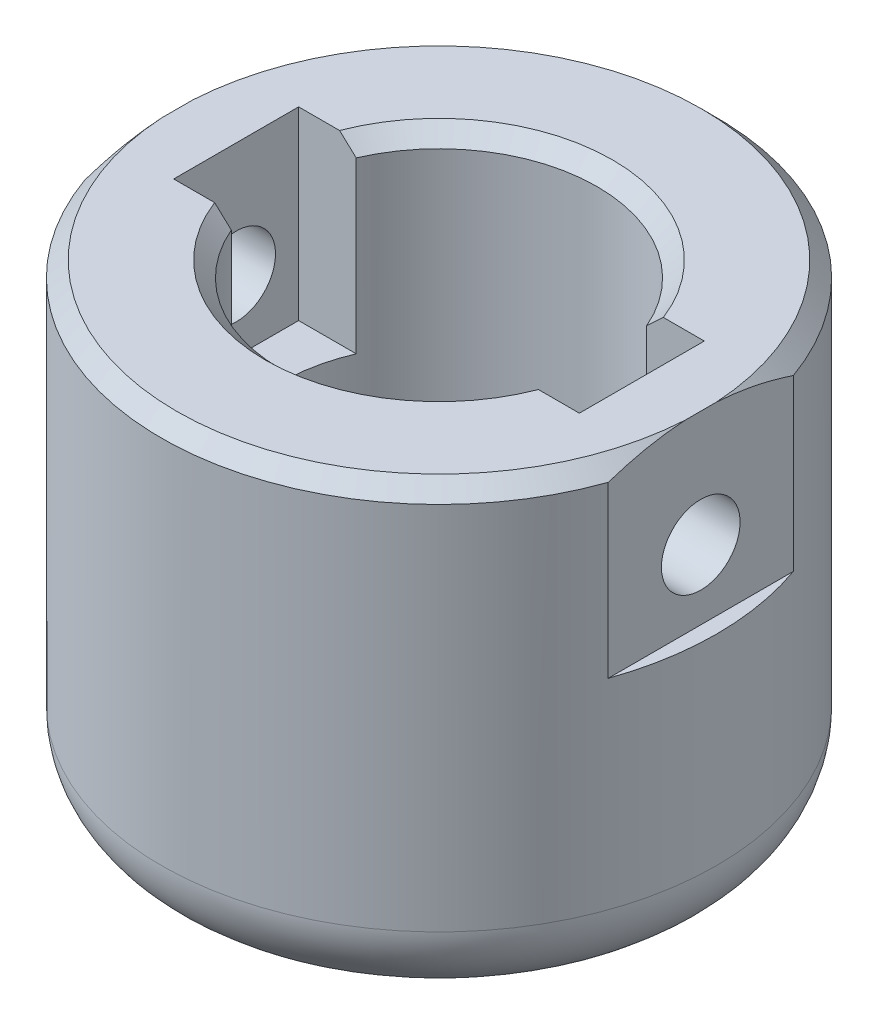
ISO-10303-21;
HEADER;
FILE_DESCRIPTION(('STEP AP214'),'2;1');
FILE_NAME('part.step','',(''),(''),'','','');
FILE_SCHEMA(('AUTOMOTIVE_DESIGN { 1 0 10303 214 1 1 1 1 }'));
ENDSEC;
DATA;
#1=APPLICATION_CONTEXT('core data for automotive mechanical design processes');
#2=APPLICATION_PROTOCOL_DEFINITION('international standard','automotive_design',2000,#1);
#3=PRODUCT_CONTEXT('',#1,'mechanical');
#4=PRODUCT('Part','Part','',(#3));
#5=PRODUCT_RELATED_PRODUCT_CATEGORY('part','',(#4));
#6=PRODUCT_DEFINITION_FORMATION('','',#4);
#7=PRODUCT_DEFINITION_CONTEXT('part definition',#1,'design');
#8=PRODUCT_DEFINITION('design','',#6,#7);
#9=PRODUCT_DEFINITION_SHAPE('','',#8);
#10=(LENGTH_UNIT() NAMED_UNIT(*) SI_UNIT(.MILLI.,.METRE.));
#11=(NAMED_UNIT(*) PLANE_ANGLE_UNIT() SI_UNIT($,.RADIAN.));
#12=(NAMED_UNIT(*) SI_UNIT($,.STERADIAN.) SOLID_ANGLE_UNIT());
#13=UNCERTAINTY_MEASURE_WITH_UNIT(LENGTH_MEASURE(1.E-05),#10,'distance_accuracy_value','');
#14=(GEOMETRIC_REPRESENTATION_CONTEXT(3) GLOBAL_UNCERTAINTY_ASSIGNED_CONTEXT((#13)) GLOBAL_UNIT_ASSIGNED_CONTEXT((#10,
#11,#12)) REPRESENTATION_CONTEXT('',''));
#15=CARTESIAN_POINT('',(0.,0.,0.));
#16=DIRECTION('',(0.,0.,1.));
#17=DIRECTION('',(1.,0.,0.));
#18=AXIS2_PLACEMENT_3D('',#15,#16,#17);
#19=CARTESIAN_POINT('',(-1.02907469966572E-13,29.9999999999999,0.));
#20=DIRECTION('',(0.,1.,0.));
#21=DIRECTION('',(-1.,0.,0.));
#22=AXIS2_PLACEMENT_3D('',#19,#20,#21);
#23=CONICAL_SURFACE('',#22,11.2500000000001,0.785398163397455);
#24=CARTESIAN_POINT('',(7.32678205705659,27.1216327745313,4.04999999999999));
#25=CARTESIAN_POINT('',(7.55646103242014,27.322689122026,4.04999999999999));
#26=CARTESIAN_POINT('',(7.78508291777011,27.5249446682732,4.04999999999999));
#27=CARTESIAN_POINT('',(8.2405597074443,27.9314252753742,4.04999999999999));
#28=CARTESIAN_POINT('',(8.4674146565239,28.1356502860474,4.04999999999999));
#29=CARTESIAN_POINT('',(8.91969403533232,28.5456309185627,4.04999999999999));
#30=CARTESIAN_POINT('',(9.14511860437239,28.751386386971,4.04999999999999));
#31=CARTESIAN_POINT('',(9.59480574969673,29.1641656456228,4.04999999999999));
#32=CARTESIAN_POINT('',(9.81906831755543,29.3711894450391,4.04999999999999));
#33=CARTESIAN_POINT('',(10.4903882449502,29.9937798775828,4.04999999999999));
#34=CARTESIAN_POINT('',(10.9360098612188,30.4108947076921,4.04999999999999));
#35=CARTESIAN_POINT('',(11.6024248378601,31.0387468195385,4.04999999999999));
#36=CARTESIAN_POINT('',(11.8242381594389,31.2484048934746,4.04999999999999));
#37=CARTESIAN_POINT('',(12.2672754085916,31.6683420659301,4.04999999999999));
#38=CARTESIAN_POINT('',(12.4884993373365,31.878621163214,4.04999999999999));
#39=CARTESIAN_POINT('',(12.7094743927895,32.08916186801,4.04999999999999));
#40=B_SPLINE_CURVE_WITH_KNOTS('',3,(#24,#25,#26,#27,#28,#29,#30,#31,#32,#33,#34,#35,#36,#37,#38,
#39),.UNSPECIFIED.,.F.,.F.,(4,2,2,2,2,2,2,4),(0.,0.915730599779071,1.83143792876012,
2.74705466005427,3.66267802114247,5.49379479082767,6.40944638032475,7.32509614926285),.UNSPECIFIED.);
#41=CARTESIAN_POINT('',(9.41594392506664,28.9999999999999,4.04999999999999));
#42=VERTEX_POINT('',#41);
#43=CARTESIAN_POINT('',(10.4957134107216,30.,4.04999999999999));
#44=VERTEX_POINT('',#43);
#45=EDGE_CURVE('E170',#42,#44,#40,.T.);
#46=ORIENTED_EDGE('',*,*,#45,.F.);
#47=CARTESIAN_POINT('',(0.,28.9999999999999,0.));
#48=DIRECTION('',(0.,1.,0.));
#49=DIRECTION('',(-1.,0.,0.));
#50=AXIS2_PLACEMENT_3D('',#47,#48,#49);
#51=CIRCLE('',#50,10.2500000000001);
#52=CARTESIAN_POINT('',(-9.41594392506684,28.9999999999999,4.05));
#53=VERTEX_POINT('',#52);
#54=EDGE_CURVE('E261',#53,#42,#51,.T.);
#55=ORIENTED_EDGE('',*,*,#54,.F.);
#56=CARTESIAN_POINT('',(-12.7094743927899,32.08916186801,4.05));
#57=CARTESIAN_POINT('',(-12.4884993373368,31.878621163214,4.05));
#58=CARTESIAN_POINT('',(-12.2672754085919,31.6683420659302,4.05));
#59=CARTESIAN_POINT('',(-11.8242381594392,31.2484048934746,4.05));
#60=CARTESIAN_POINT('',(-11.6024248378604,31.0387468195385,4.05));
#61=CARTESIAN_POINT('',(-10.9360098612191,30.4108947076921,4.05));
#62=CARTESIAN_POINT('',(-10.4903882449504,29.9937798775828,4.05));
#63=CARTESIAN_POINT('',(-9.81906831755565,29.3711894450391,4.05));
#64=CARTESIAN_POINT('',(-9.59480574969695,29.1641656456227,4.05));
#65=CARTESIAN_POINT('',(-9.14511860437259,28.751386386971,4.05));
#66=CARTESIAN_POINT('',(-8.91969403533251,28.5456309185627,4.05));
#67=CARTESIAN_POINT('',(-8.46741465652407,28.1356502860474,4.05));
#68=CARTESIAN_POINT('',(-8.24055970744446,27.9314252753741,4.05));
#69=CARTESIAN_POINT('',(-7.78508291777025,27.5249446682731,4.05));
#70=CARTESIAN_POINT('',(-7.55646103242027,27.3226891220259,4.05));
#71=CARTESIAN_POINT('',(-7.32678205705671,27.1216327745312,4.05));
#72=B_SPLINE_CURVE_WITH_KNOTS('',3,(#56,#57,#58,#59,#60,#61,#62,#63,#64,#65,#66,#67,#68,#69,#70,
#71),.UNSPECIFIED.,.F.,.F.,(4,2,2,2,2,2,2,4),(0.,0.915649768938141,1.83130135843525,
3.66241812812051,4.57804148920874,5.49365822050293,6.40936554948401,7.32509614926312),.UNSPECIFIED.);
#73=CARTESIAN_POINT('',(-10.4957134107218,29.9999999999999,4.05));
#74=VERTEX_POINT('',#73);
#75=EDGE_CURVE('E405',#74,#53,#72,.T.);
#76=ORIENTED_EDGE('',*,*,#75,.F.);
#77=CARTESIAN_POINT('',(-1.02907469966573E-13,30.,0.));
#78=DIRECTION('',(0.,1.,0.));
#79=DIRECTION('',(-1.,0.,0.));
#80=AXIS2_PLACEMENT_3D('',#77,#78,#79);
#81=CIRCLE('',#80,11.2500000000001);
#82=EDGE_CURVE('E263',#44,#74,#81,.F.);
#83=ORIENTED_EDGE('',*,*,#82,.F.);
#84=EDGE_LOOP('',(#46,#55,#76,#83));
#85=FACE_BOUND('',#84,.T.);
#86=ADVANCED_FACE('F35',(#85),#23,.F.);
#87=CARTESIAN_POINT('',(0.,29.0000000000001,0.));
#88=DIRECTION('',(0.,-1.,0.));
#89=DIRECTION('',(1.,0.,0.));
#90=AXIS2_PLACEMENT_3D('',#87,#88,#89);
#91=CONICAL_SURFACE('',#90,18.,0.785398163397464);
#92=CARTESIAN_POINT('',(16.970562748477,25.4847781561522,-13.2251567472752));
#93=CARTESIAN_POINT('',(16.970562748477,25.6809351306165,-12.9059945777759));
#94=CARTESIAN_POINT('',(16.970562748477,25.8739384322977,-12.5848645366506));
#95=CARTESIAN_POINT('',(16.970562748477,26.2526520620676,-11.9382352634281));
#96=CARTESIAN_POINT('',(16.970562748477,26.4383606563974,-11.6127350170208));
#97=CARTESIAN_POINT('',(16.970562748477,26.8021308972379,-10.9557724507042));
#98=CARTESIAN_POINT('',(16.970562748477,26.9801590236808,-10.6242915048748));
#99=CARTESIAN_POINT('',(16.970562748477,27.3265019852374,-9.95631004758649));
#100=CARTESIAN_POINT('',(16.970562748477,27.4948174079489,-9.6198098413353));
#101=CARTESIAN_POINT('',(16.970562748477,27.8236697209714,-8.93442079746645));
#102=CARTESIAN_POINT('',(16.970562748477,27.9839741115656,-8.58541963608094));
#103=CARTESIAN_POINT('',(16.970562748477,28.2912045937466,-7.88158196486785));
#104=CARTESIAN_POINT('',(16.970562748477,28.4381296218007,-7.52674499379091));
#105=CARTESIAN_POINT('',(16.970562748477,28.8554737690785,-6.45421418256346));
#106=CARTESIAN_POINT('',(16.9705627484771,29.1030742609521,-5.72725460602414));
#107=CARTESIAN_POINT('',(16.9705627484771,29.4509584376996,-4.49384532216474));
#108=CARTESIAN_POINT('',(16.9705627484771,29.5729119345977,-3.99348322231232));
#109=CARTESIAN_POINT('',(16.9705627484771,29.7761029875689,-2.98439373835375));
#110=CARTESIAN_POINT('',(16.9705627484771,29.8573401630234,-2.47566627609363));
#111=CARTESIAN_POINT('',(16.9705627484771,29.9743557820314,-1.4579107639439));
#112=CARTESIAN_POINT('',(16.9705627484771,30.0105646746437,-0.948932836033983));
#113=CARTESIAN_POINT('',(16.9705627484771,30.0369369291092,0.0702136808183589));
#114=CARTESIAN_POINT('',(16.9705627484771,30.0271025181523,0.580382210976276));
#115=CARTESIAN_POINT('',(16.9705627484771,29.9619819000151,1.59731811758356));
#116=CARTESIAN_POINT('',(16.9705627484771,29.9067350019954,2.10408805353443));
#117=CARTESIAN_POINT('',(16.9705627484771,29.7538035014175,3.11114117673942));
#118=CARTESIAN_POINT('',(16.9705627484771,29.6561142825717,3.61142365228008));
#119=CARTESIAN_POINT('',(16.9705627484771,29.421819609194,4.60750109563117));
#120=CARTESIAN_POINT('',(16.9705627484771,29.2848668000616,5.1032133198858));
#121=CARTESIAN_POINT('',(16.9705627484771,28.9778032291246,6.08413459839825));
#122=CARTESIAN_POINT('',(16.9705627484771,28.8076924054738,6.56934363306369));
#123=CARTESIAN_POINT('',(16.9705627484771,28.4145958833882,7.59412108388862));
#124=CARTESIAN_POINT('',(16.9705627484771,28.1875672809049,8.13212787077785));
#125=CARTESIAN_POINT('',(16.9705627484772,27.7043221723622,9.19496333475703));
#126=CARTESIAN_POINT('',(16.9705627484772,27.4480949410739,9.71978708250893));
#127=CARTESIAN_POINT('',(16.9705627484772,26.9172019887956,10.7474979573489));
#128=CARTESIAN_POINT('',(16.9705627484772,26.6429729495695,11.25061195798));
#129=CARTESIAN_POINT('',(16.9705627484772,26.2180672226552,11.9971012190895));
#130=CARTESIAN_POINT('',(16.9705627484772,26.0742589733062,12.2444262333171));
#131=CARTESIAN_POINT('',(16.9705627484772,25.7825129161461,12.736600078464));
#132=CARTESIAN_POINT('',(16.9705627484772,25.634575479165,12.9814491290691));
#133=CARTESIAN_POINT('',(16.9705627484772,25.4847781561522,13.225156747275));
#134=B_SPLINE_CURVE_WITH_KNOTS('',3,(#92,#93,#94,#95,#96,#97,#98,#99,#100,#101,#102,#103,#104,
#105,#106,#107,#108,#109,#110,#111,#112,#113,#114,#115,#116,#117,#118,#119,#120,#121,#122,#123,
#124,#125,#126,#127,#128,#129,#130,#131,#132,#133),.UNSPECIFIED.,.F.,.F.,(4,2,2,2,2,2,2,2,2,2,2,
2,2,2,2,2,2,2,2,2,4),(0.,1.12388643091389,2.2480383832806,3.37668213494155,4.50525753432825,
5.65714564160895,6.80912523330326,9.10893094696375,10.6525600084569,12.196203499612,
13.7249741374504,15.2536708269222,16.7810456644986,18.3085866703467,19.8500820421742,
21.3915802892202,23.1423260230731,24.8937169257438,26.612214301044,27.4704677446396,
28.32864435746),.UNSPECIFIED.);
#135=CARTESIAN_POINT('',(16.9705627484771,29.0000000000002,-6.00000000000001));
#136=VERTEX_POINT('',#135);
#137=CARTESIAN_POINT('',(16.9705627484771,30.,-1.00000000000181));
#138=VERTEX_POINT('',#137);
#139=EDGE_CURVE('E219',#136,#138,#134,.T.);
#140=ORIENTED_EDGE('',*,*,#139,.F.);
#141=CARTESIAN_POINT('',(0.,29.0000000000001,0.));
#142=DIRECTION('',(0.,1.,0.));
#143=DIRECTION('',(-1.,0.,0.));
#144=AXIS2_PLACEMENT_3D('',#141,#142,#143);
#145=CIRCLE('',#144,18.);
#146=CARTESIAN_POINT('',(-16.9705627484773,29.,-6.00000000000001));
#147=VERTEX_POINT('',#146);
#148=EDGE_CURVE('E277',#147,#136,#145,.F.);
#149=ORIENTED_EDGE('',*,*,#148,.F.);
#150=CARTESIAN_POINT('',(-16.9705627484773,25.4847781561519,13.2251567472754));
#151=CARTESIAN_POINT('',(-16.9705627484773,25.6809351306162,12.905994577776));
#152=CARTESIAN_POINT('',(-16.9705627484773,25.8739384322975,12.5848645366507));
#153=CARTESIAN_POINT('',(-16.9705627484773,26.2526520620674,11.9382352634282));
#154=CARTESIAN_POINT('',(-16.9705627484773,26.4383606563972,11.6127350170209));
#155=CARTESIAN_POINT('',(-16.9705627484773,26.8021308972376,10.9557724507042));
#156=CARTESIAN_POINT('',(-16.9705627484773,26.9801590236805,10.6242915048749));
#157=CARTESIAN_POINT('',(-16.9705627484773,27.3265019852371,9.95631004758655));
#158=CARTESIAN_POINT('',(-16.9705627484773,27.4948174079487,9.61980984133535));
#159=CARTESIAN_POINT('',(-16.9705627484773,27.8236697209713,8.9344207974665));
#160=CARTESIAN_POINT('',(-16.9705627484773,27.9839741115654,8.58541963608098));
#161=CARTESIAN_POINT('',(-16.9705627484773,28.2912045937464,7.88158196486788));
#162=CARTESIAN_POINT('',(-16.9705627484773,28.4381296218006,7.52674499379094));
#163=CARTESIAN_POINT('',(-16.9705627484773,28.8554737690783,6.45421418256347));
#164=CARTESIAN_POINT('',(-16.9705627484773,29.103074260952,5.72725460602413));
#165=CARTESIAN_POINT('',(-16.9705627484773,29.4509584376994,4.49384532216471));
#166=CARTESIAN_POINT('',(-16.9705627484773,29.5729119345976,3.99348322231229));
#167=CARTESIAN_POINT('',(-16.9705627484773,29.7761029875688,2.98439373835372));
#168=CARTESIAN_POINT('',(-16.9705627484773,29.8573401630233,2.47566627609361));
#169=CARTESIAN_POINT('',(-16.9705627484773,29.9743557820313,1.45791076394387));
#170=CARTESIAN_POINT('',(-16.9705627484773,30.0105646746436,0.948932836033951));
#171=CARTESIAN_POINT('',(-16.9705627484773,30.0369369291091,-0.0702136808183932));
#172=CARTESIAN_POINT('',(-16.9705627484773,30.0271025181521,-0.580382210976311));
#173=CARTESIAN_POINT('',(-16.9705627484773,29.9619819000149,-1.5973181175836));
#174=CARTESIAN_POINT('',(-16.9705627484773,29.9067350019953,-2.10408805353447));
#175=CARTESIAN_POINT('',(-16.9705627484773,29.7538035014174,-3.11114117673946));
#176=CARTESIAN_POINT('',(-16.9705627484773,29.6561142825717,-3.61142365228013));
#177=CARTESIAN_POINT('',(-16.9705627484773,29.4218196091939,-4.60750109563122));
#178=CARTESIAN_POINT('',(-16.9705627484773,29.2848668000615,-5.10321331988585));
#179=CARTESIAN_POINT('',(-16.9705627484773,28.9778032291245,-6.08413459839831));
#180=CARTESIAN_POINT('',(-16.9705627484773,28.8076924054737,-6.56934363306374));
#181=CARTESIAN_POINT('',(-16.9705627484773,28.4145958833881,-7.59412108388871));
#182=CARTESIAN_POINT('',(-16.9705627484773,28.1875672809048,-8.13212787077796));
#183=CARTESIAN_POINT('',(-16.9705627484773,27.7043221723621,-9.1949633347572));
#184=CARTESIAN_POINT('',(-16.9705627484773,27.4480949410737,-9.71978708250913));
#185=CARTESIAN_POINT('',(-16.9705627484773,26.9172019887954,-10.7474979573491));
#186=CARTESIAN_POINT('',(-16.9705627484773,26.6429729495693,-11.2506119579802));
#187=CARTESIAN_POINT('',(-16.9705627484773,26.2180672226549,-11.9971012190899));
#188=CARTESIAN_POINT('',(-16.9705627484773,26.074258973306,-12.2444262333174));
#189=CARTESIAN_POINT('',(-16.9705627484773,25.7825129161458,-12.7366000784644));
#190=CARTESIAN_POINT('',(-16.9705627484773,25.6345754791648,-12.9814491290694));
#191=CARTESIAN_POINT('',(-16.9705627484773,25.4847781561519,-13.2251567472754));
#192=B_SPLINE_CURVE_WITH_KNOTS('',3,(#150,#151,#152,#153,#154,#155,#156,#157,#158,#159,#160,
#161,#162,#163,#164,#165,#166,#167,#168,#169,#170,#171,#172,#173,#174,#175,#176,#177,#178,#179,
#180,#181,#182,#183,#184,#185,#186,#187,#188,#189,#190,#191),.UNSPECIFIED.,.F.,.F.,(4,2,2,2,2,2,
2,2,2,2,2,2,2,2,2,2,2,2,2,2,4),(0.,1.12388643091392,2.24803838328065,3.37668213494162,
4.50525753432834,5.65714564160906,6.80912523330339,9.10893094696392,10.6525600084571,
12.1962034996122,13.7249741374506,15.2536708269224,16.7810456644987,18.3085866703469,
19.8500820421744,21.3915802892204,23.1423260230734,24.8937169257442,26.6122143010445,
27.4704677446401,28.3286443574606),.UNSPECIFIED.);
#193=CARTESIAN_POINT('',(-16.9705627484773,29.9999999999999,-1.00000000000164));
#194=VERTEX_POINT('',#193);
#195=EDGE_CURVE('E155',#194,#147,#192,.T.);
#196=ORIENTED_EDGE('',*,*,#195,.F.);
#197=CARTESIAN_POINT('',(-1.02907469966573E-13,30.,0.));
#198=DIRECTION('',(0.,1.,0.));
#199=DIRECTION('',(-1.,0.,0.));
#200=AXIS2_PLACEMENT_3D('',#197,#198,#199);
#201=CIRCLE('',#200,17.0000000000001);
#202=EDGE_CURVE('E301',#138,#194,#201,.T.);
#203=ORIENTED_EDGE('',*,*,#202,.F.);
#204=EDGE_LOOP('',(#140,#149,#196,#203));
#205=FACE_BOUND('',#204,.T.);
#206=ADVANCED_FACE('F240',(#205),#91,.T.);
#207=CARTESIAN_POINT('',(1.46504285751069E-12,-427.095192794044,0.));
#208=DIRECTION('',(0.,-1.,0.));
#209=DIRECTION('',(1.,0.,0.));
#210=AXIS2_PLACEMENT_3D('',#207,#208,#209);
#211=CYLINDRICAL_SURFACE('',#210,18.);
#212=DIRECTION('',(0.,1.,0.));
#213=VECTOR('',#212,1.);
#214=CARTESIAN_POINT('',(16.9705627484772,18.,5.99999999999977));
#215=LINE('',#214,#213);
#216=CARTESIAN_POINT('',(16.9705627484772,18.,5.99999999999977));
#217=VERTEX_POINT('',#216);
#218=CARTESIAN_POINT('',(16.9705627484771,29.0000000000002,5.99999999999977));
#219=VERTEX_POINT('',#218);
#220=EDGE_CURVE('E344',#217,#219,#215,.T.);
#221=ORIENTED_EDGE('',*,*,#220,.T.);
#222=CARTESIAN_POINT('',(-16.9705627484773,29.,5.99999999999999));
#223=VERTEX_POINT('',#222);
#224=EDGE_CURVE('E274',#219,#223,#145,.F.);
#225=ORIENTED_EDGE('',*,*,#224,.T.);
#226=DIRECTION('',(0.,1.,0.));
#227=VECTOR('',#226,1.);
#228=CARTESIAN_POINT('',(-16.9705627484773,17.9999999999999,5.99999999999999));
#229=LINE('',#228,#227);
#230=CARTESIAN_POINT('',(-16.9705627484773,17.9999999999999,5.99999999999999));
#231=VERTEX_POINT('',#230);
#232=EDGE_CURVE('E160',#231,#223,#229,.T.);
#233=ORIENTED_EDGE('',*,*,#232,.F.);
#234=CARTESIAN_POINT('',(0.,18.,0.));
#235=DIRECTION('',(0.,-1.,0.));
#236=DIRECTION('',(1.,0.,0.));
#237=AXIS2_PLACEMENT_3D('',#234,#235,#236);
#238=CIRCLE('',#237,18.);
#239=CARTESIAN_POINT('',(-16.9705627484773,17.9999999999999,-6.00000000000001));
#240=VERTEX_POINT('',#239);
#241=EDGE_CURVE('E44',#240,#231,#238,.F.);
#242=ORIENTED_EDGE('',*,*,#241,.F.);
#243=DIRECTION('',(0.,1.,0.));
#244=VECTOR('',#243,1.);
#245=CARTESIAN_POINT('',(-16.9705627484773,17.9999999999999,-6.00000000000001));
#246=LINE('',#245,#244);
#247=EDGE_CURVE('E149',#240,#147,#246,.T.);
#248=ORIENTED_EDGE('',*,*,#247,.T.);
#249=ORIENTED_EDGE('',*,*,#148,.T.);
#250=DIRECTION('',(0.,1.,0.));
#251=VECTOR('',#250,1.);
#252=CARTESIAN_POINT('',(16.9705627484771,18.,-6.00000000000001));
#253=LINE('',#252,#251);
#254=CARTESIAN_POINT('',(16.9705627484771,18.,-6.00000000000001));
#255=VERTEX_POINT('',#254);
#256=EDGE_CURVE('E342',#255,#136,#253,.T.);
#257=ORIENTED_EDGE('',*,*,#256,.F.);
#258=CARTESIAN_POINT('',(0.,18.,0.));
#259=DIRECTION('',(0.,1.,0.));
#260=DIRECTION('',(-1.,0.,0.));
#261=AXIS2_PLACEMENT_3D('',#258,#259,#260);
#262=CIRCLE('',#261,18.);
#263=EDGE_CURVE('E12',#255,#217,#262,.F.);
#264=ORIENTED_EDGE('',*,*,#263,.T.);
#265=EDGE_LOOP('',(#221,#225,#233,#242,#248,#249,#257,#264));
#266=FACE_BOUND('',#265,.T.);
#267=CARTESIAN_POINT('',(0.,4.99999999999995,0.));
#268=DIRECTION('',(0.,-1.,0.));
#269=DIRECTION('',(1.,0.,0.));
#270=AXIS2_PLACEMENT_3D('',#267,#268,#269);
#271=CIRCLE('',#270,18.);
#272=CARTESIAN_POINT('',(18.,5.00000000000001,0.));
#273=VERTEX_POINT('',#272);
#274=EDGE_CURVE('E286',#273,#273,#271,.F.);
#275=ORIENTED_EDGE('',*,*,#274,.T.);
#276=EDGE_LOOP('',(#275));
#277=FACE_BOUND('',#276,.T.);
#278=ADVANCED_FACE('F167',(#266,#277),#211,.T.);
#279=CARTESIAN_POINT('',(18.,0.,0.));
#280=DIRECTION('',(0.,-1.,0.));
#281=DIRECTION('',(1.,0.,0.));
#282=AXIS2_PLACEMENT_3D('',#279,#280,#281);
#283=PLANE('',#282);
#284=CARTESIAN_POINT('',(0.,0.,0.));
#285=DIRECTION('',(0.,-1.,0.));
#286=DIRECTION('',(1.,0.,0.));
#287=AXIS2_PLACEMENT_3D('',#284,#285,#286);
#288=CIRCLE('',#287,13.);
#289=CARTESIAN_POINT('',(13.,0.,0.));
#290=VERTEX_POINT('',#289);
#291=EDGE_CURVE('E284',#290,#290,#288,.T.);
#292=ORIENTED_EDGE('',*,*,#291,.T.);
#293=EDGE_LOOP('',(#292));
#294=FACE_BOUND('',#293,.T.);
#295=CARTESIAN_POINT('',(0.,0.,0.));
#296=DIRECTION('',(0.,-1.,0.));
#297=DIRECTION('',(1.,0.,0.));
#298=AXIS2_PLACEMENT_3D('',#295,#296,#297);
#299=CIRCLE('',#298,5.25);
#300=CARTESIAN_POINT('',(5.25,0.,0.));
#301=VERTEX_POINT('',#300);
#302=EDGE_CURVE('E310',#301,#301,#299,.T.);
#303=ORIENTED_EDGE('',*,*,#302,.F.);
#304=EDGE_LOOP('',(#303));
#305=FACE_BOUND('',#304,.T.);
#306=ADVANCED_FACE('F430',(#294,#305),#283,.T.);
#307=CARTESIAN_POINT('',(1.46504285751069E-12,-427.095192794044,0.));
#308=DIRECTION('',(0.,-1.,0.));
#309=DIRECTION('',(1.,0.,0.));
#310=AXIS2_PLACEMENT_3D('',#307,#308,#309);
#311=CYLINDRICAL_SURFACE('',#310,5.25000000000001);
#312=ORIENTED_EDGE('',*,*,#302,.T.);
#313=EDGE_LOOP('',(#312));
#314=FACE_BOUND('',#313,.T.);
#315=CARTESIAN_POINT('',(0.,3.,0.));
#316=DIRECTION('',(0.,-1.,0.));
#317=DIRECTION('',(1.,0.,0.));
#318=AXIS2_PLACEMENT_3D('',#315,#316,#317);
#319=CIRCLE('',#318,5.25000000000001);
#320=CARTESIAN_POINT('',(5.25,3.00000000000002,0.));
#321=VERTEX_POINT('',#320);
#322=EDGE_CURVE('E313',#321,#321,#319,.T.);
#323=ORIENTED_EDGE('',*,*,#322,.F.);
#324=EDGE_LOOP('',(#323));
#325=FACE_BOUND('',#324,.T.);
#326=ADVANCED_FACE('F426',(#314,#325),#311,.F.);
#327=CARTESIAN_POINT('',(5.25,2.99999999999999,0.));
#328=DIRECTION('',(0.,1.,0.));
#329=DIRECTION('',(-1.,0.,0.));
#330=AXIS2_PLACEMENT_3D('',#327,#328,#329);
#331=PLANE('',#330);
#332=CARTESIAN_POINT('',(0.,2.99999999999997,0.));
#333=DIRECTION('',(0.,1.,0.));
#334=DIRECTION('',(-1.,0.,0.));
#335=AXIS2_PLACEMENT_3D('',#332,#333,#334);
#336=CIRCLE('',#335,9.25000000000006);
#337=CARTESIAN_POINT('',(-9.25000000000007,2.99999999999994,0.));
#338=VERTEX_POINT('',#337);
#339=EDGE_CURVE('E303',#338,#338,#336,.T.);
#340=ORIENTED_EDGE('',*,*,#339,.T.);
#341=EDGE_LOOP('',(#340));
#342=FACE_BOUND('',#341,.T.);
#343=ORIENTED_EDGE('',*,*,#322,.T.);
#344=EDGE_LOOP('',(#343));
#345=FACE_BOUND('',#344,.T.);
#346=ADVANCED_FACE('F423',(#342,#345),#331,.T.);
#347=CARTESIAN_POINT('',(1.46504285751069E-12,-427.095192794044,0.));
#348=DIRECTION('',(0.,-1.,0.));
#349=DIRECTION('',(1.,0.,0.));
#350=AXIS2_PLACEMENT_3D('',#347,#348,#349);
#351=CYLINDRICAL_SURFACE('',#350,10.2500000000001);
#352=DIRECTION('',(0.,1.,0.));
#353=VECTOR('',#352,1.);
#354=CARTESIAN_POINT('',(9.41594392506668,18.,4.04999999999999));
#355=LINE('',#354,#353);
#356=CARTESIAN_POINT('',(9.41594392506668,18.,4.04999999999999));
#357=VERTEX_POINT('',#356);
#358=EDGE_CURVE('E271',#357,#42,#355,.T.);
#359=ORIENTED_EDGE('',*,*,#358,.F.);
#360=CARTESIAN_POINT('',(0.,18.,0.));
#361=DIRECTION('',(0.,-1.,0.));
#362=DIRECTION('',(-1.,0.,0.));
#363=AXIS2_PLACEMENT_3D('',#360,#361,#362);
#364=CIRCLE('',#363,10.2500000000001);
#365=CARTESIAN_POINT('',(9.41594392506668,18.,-4.05));
#366=VERTEX_POINT('',#365);
#367=EDGE_CURVE('E357',#366,#357,#364,.T.);
#368=ORIENTED_EDGE('',*,*,#367,.F.);
#369=DIRECTION('',(0.,1.,0.));
#370=VECTOR('',#369,1.);
#371=CARTESIAN_POINT('',(9.41594392506668,18.,-4.05));
#372=LINE('',#371,#370);
#373=CARTESIAN_POINT('',(9.41594392506664,29.,-4.05));
#374=VERTEX_POINT('',#373);
#375=EDGE_CURVE('E359',#366,#374,#372,.T.);
#376=ORIENTED_EDGE('',*,*,#375,.T.);
#377=CARTESIAN_POINT('',(-9.41594392506683,28.9999999999999,-4.05000000000001));
#378=VERTEX_POINT('',#377);
#379=EDGE_CURVE('E275',#374,#378,#51,.T.);
#380=ORIENTED_EDGE('',*,*,#379,.T.);
#381=DIRECTION('',(0.,1.,0.));
#382=VECTOR('',#381,1.);
#383=CARTESIAN_POINT('',(-9.4159439250668,17.9999999999999,-4.05));
#384=LINE('',#383,#382);
#385=CARTESIAN_POINT('',(-9.4159439250668,17.9999999999999,-4.05));
#386=VERTEX_POINT('',#385);
#387=EDGE_CURVE('E59',#386,#378,#384,.T.);
#388=ORIENTED_EDGE('',*,*,#387,.F.);
#389=CARTESIAN_POINT('',(0.,18.,0.));
#390=DIRECTION('',(0.,-1.,0.));
#391=DIRECTION('',(-1.,0.,0.));
#392=AXIS2_PLACEMENT_3D('',#389,#390,#391);
#393=CIRCLE('',#392,10.2500000000001);
#394=CARTESIAN_POINT('',(-9.4159439250668,17.9999999999999,4.05));
#395=VERTEX_POINT('',#394);
#396=EDGE_CURVE('E337',#395,#386,#393,.T.);
#397=ORIENTED_EDGE('',*,*,#396,.F.);
#398=DIRECTION('',(0.,1.,0.));
#399=VECTOR('',#398,1.);
#400=CARTESIAN_POINT('',(-9.4159439250668,17.9999999999999,4.05));
#401=LINE('',#400,#399);
#402=EDGE_CURVE('E273',#395,#53,#401,.T.);
#403=ORIENTED_EDGE('',*,*,#402,.T.);
#404=ORIENTED_EDGE('',*,*,#54,.T.);
#405=EDGE_LOOP('',(#359,#368,#376,#380,#388,#397,#403,#404));
#406=FACE_BOUND('',#405,.T.);
#407=CARTESIAN_POINT('',(0.,4.,0.));
#408=DIRECTION('',(0.,1.,0.));
#409=DIRECTION('',(-1.,0.,0.));
#410=AXIS2_PLACEMENT_3D('',#407,#408,#409);
#411=CIRCLE('',#410,10.2500000000001);
#412=CARTESIAN_POINT('',(-10.2500000000001,3.99999999999997,0.));
#413=VERTEX_POINT('',#412);
#414=EDGE_CURVE('E307',#413,#413,#411,.F.);
#415=ORIENTED_EDGE('',*,*,#414,.T.);
#416=EDGE_LOOP('',(#415));
#417=FACE_BOUND('',#416,.T.);
#418=ADVANCED_FACE('F268',(#406,#417),#351,.F.);
#419=CARTESIAN_POINT('',(10.25,30.,0.));
#420=DIRECTION('',(0.,1.,0.));
#421=DIRECTION('',(-1.,0.,0.));
#422=AXIS2_PLACEMENT_3D('',#419,#420,#421);
#423=PLANE('',#422);
#424=DIRECTION('',(0.,0.,1.));
#425=VECTOR('',#424,1.);
#426=CARTESIAN_POINT('',(16.9705627484771,30.,5.99999999999977));
#427=LINE('',#426,#425);
#428=CARTESIAN_POINT('',(16.9705627484771,30.,1.00000000000157));
#429=VERTEX_POINT('',#428);
#430=EDGE_CURVE('E348',#138,#429,#427,.T.);
#431=ORIENTED_EDGE('',*,*,#430,.F.);
#432=ORIENTED_EDGE('',*,*,#202,.T.);
#433=DIRECTION('',(0.,0.,-1.));
#434=VECTOR('',#433,1.);
#435=CARTESIAN_POINT('',(-16.9705627484773,29.9999999999999,5.99999999999999));
#436=LINE('',#435,#434);
#437=CARTESIAN_POINT('',(-16.9705627484773,29.9999999999999,1.00000000000164));
#438=VERTEX_POINT('',#437);
#439=EDGE_CURVE('E164',#438,#194,#436,.T.);
#440=ORIENTED_EDGE('',*,*,#439,.F.);
#441=EDGE_CURVE('E299',#438,#429,#201,.T.);
#442=ORIENTED_EDGE('',*,*,#441,.T.);
#443=EDGE_LOOP('',(#431,#432,#440,#442));
#444=FACE_BOUND('',#443,.T.);
#445=DIRECTION('',(1.,0.,0.));
#446=VECTOR('',#445,1.);
#447=CARTESIAN_POINT('',(13.15,30.,4.04999999999999));
#448=LINE('',#447,#446);
#449=CARTESIAN_POINT('',(13.15,30.,4.04999999999999));
#450=VERTEX_POINT('',#449);
#451=EDGE_CURVE('E347',#44,#450,#448,.T.);
#452=ORIENTED_EDGE('',*,*,#451,.F.);
#453=ORIENTED_EDGE('',*,*,#82,.T.);
#454=DIRECTION('',(1.,0.,0.));
#455=VECTOR('',#454,1.);
#456=CARTESIAN_POINT('',(-13.1500000000002,29.9999999999999,4.05));
#457=LINE('',#456,#455);
#458=CARTESIAN_POINT('',(-13.1500000000002,29.9999999999999,4.05));
#459=VERTEX_POINT('',#458);
#460=EDGE_CURVE('E330',#459,#74,#457,.T.);
#461=ORIENTED_EDGE('',*,*,#460,.F.);
#462=DIRECTION('',(0.,0.,1.));
#463=VECTOR('',#462,1.);
#464=CARTESIAN_POINT('',(-13.1500000000002,29.9999999999999,4.05));
#465=LINE('',#464,#463);
#466=CARTESIAN_POINT('',(-13.1500000000002,29.9999999999999,-4.05));
#467=VERTEX_POINT('',#466);
#468=EDGE_CURVE('E324',#467,#459,#465,.T.);
#469=ORIENTED_EDGE('',*,*,#468,.F.);
#470=DIRECTION('',(-1.,0.,0.));
#471=VECTOR('',#470,1.);
#472=CARTESIAN_POINT('',(-13.1500000000002,29.9999999999999,-4.05));
#473=LINE('',#472,#471);
#474=CARTESIAN_POINT('',(-10.4957134107218,29.9999999999999,-4.05));
#475=VERTEX_POINT('',#474);
#476=EDGE_CURVE('E328',#475,#467,#473,.T.);
#477=ORIENTED_EDGE('',*,*,#476,.F.);
#478=CARTESIAN_POINT('',(10.4957134107216,30.,-4.05));
#479=VERTEX_POINT('',#478);
#480=EDGE_CURVE('E280',#475,#479,#81,.F.);
#481=ORIENTED_EDGE('',*,*,#480,.T.);
#482=DIRECTION('',(-1.,0.,0.));
#483=VECTOR('',#482,1.);
#484=CARTESIAN_POINT('',(13.15,30.,-4.05));
#485=LINE('',#484,#483);
#486=CARTESIAN_POINT('',(13.15,30.,-4.05));
#487=VERTEX_POINT('',#486);
#488=EDGE_CURVE('E51',#487,#479,#485,.T.);
#489=ORIENTED_EDGE('',*,*,#488,.F.);
#490=DIRECTION('',(0.,0.,-1.));
#491=VECTOR('',#490,1.);
#492=CARTESIAN_POINT('',(13.15,30.,4.04999999999999));
#493=LINE('',#492,#491);
#494=EDGE_CURVE('E365',#450,#487,#493,.T.);
#495=ORIENTED_EDGE('',*,*,#494,.F.);
#496=EDGE_LOOP('',(#452,#453,#461,#469,#477,#481,#489,#495));
#497=FACE_BOUND('',#496,.T.);
#498=ADVANCED_FACE('F297',(#444,#497),#423,.T.);
#499=CARTESIAN_POINT('',(0.,4.,0.));
#500=DIRECTION('',(0.,1.,0.));
#501=DIRECTION('',(-1.,0.,0.));
#502=AXIS2_PLACEMENT_3D('',#499,#500,#501);
#503=TOROIDAL_SURFACE('',#502,9.25000000000006,1.);
#504=ORIENTED_EDGE('',*,*,#339,.F.);
#505=EDGE_LOOP('',(#504));
#506=FACE_BOUND('',#505,.T.);
#507=ORIENTED_EDGE('',*,*,#414,.F.);
#508=EDGE_LOOP('',(#507));
#509=FACE_BOUND('',#508,.T.);
#510=ADVANCED_FACE('F247',(#506,#509),#503,.F.);
#511=CARTESIAN_POINT('',(12.7094743927895,32.08916186801,-4.05));
#512=CARTESIAN_POINT('',(12.4884993373365,31.878621163214,-4.05));
#513=CARTESIAN_POINT('',(12.2672754085916,31.6683420659302,-4.05));
#514=CARTESIAN_POINT('',(11.8242381594389,31.2484048934746,-4.05));
#515=CARTESIAN_POINT('',(11.6024248378601,31.0387468195385,-4.05));
#516=CARTESIAN_POINT('',(10.9360098612188,30.4108947076921,-4.05));
#517=CARTESIAN_POINT('',(10.4903882449502,29.9937798775828,-4.05));
#518=CARTESIAN_POINT('',(9.81906831755543,29.3711894450391,-4.05));
#519=CARTESIAN_POINT('',(9.59480574969673,29.1641656456228,-4.05));
#520=CARTESIAN_POINT('',(9.14511860437239,28.751386386971,-4.05));
#521=CARTESIAN_POINT('',(8.91969403533232,28.5456309185627,-4.05));
#522=CARTESIAN_POINT('',(8.4674146565239,28.1356502860474,-4.05));
#523=CARTESIAN_POINT('',(8.2405597074443,27.9314252753742,-4.05));
#524=CARTESIAN_POINT('',(7.7850829177701,27.5249446682732,-4.05));
#525=CARTESIAN_POINT('',(7.55646103242014,27.322689122026,-4.05));
#526=CARTESIAN_POINT('',(7.32678205705658,27.1216327745313,-4.05));
#527=B_SPLINE_CURVE_WITH_KNOTS('',3,(#511,#512,#513,#514,#515,#516,#517,#518,#519,#520,#521,
#522,#523,#524,#525,#526),.UNSPECIFIED.,.F.,.F.,(4,2,2,2,2,2,2,4),(0.,0.915649768938106,
1.83130135843518,3.66241812812038,4.57804148920858,5.49365822050274,6.40936554948379,
7.32509614926286),.UNSPECIFIED.);
#528=EDGE_CURVE('E172',#479,#374,#527,.T.);
#529=ORIENTED_EDGE('',*,*,#528,.F.);
#530=ORIENTED_EDGE('',*,*,#480,.F.);
#531=CARTESIAN_POINT('',(-7.32678205705671,27.1216327745312,-4.05));
#532=CARTESIAN_POINT('',(-7.55646103242027,27.3226891220259,-4.05));
#533=CARTESIAN_POINT('',(-7.78508291777025,27.5249446682731,-4.05));
#534=CARTESIAN_POINT('',(-8.24055970744446,27.9314252753741,-4.05));
#535=CARTESIAN_POINT('',(-8.46741465652407,28.1356502860474,-4.05));
#536=CARTESIAN_POINT('',(-8.91969403533251,28.5456309185627,-4.05));
#537=CARTESIAN_POINT('',(-9.14511860437259,28.751386386971,-4.05));
#538=CARTESIAN_POINT('',(-9.59480574969695,29.1641656456228,-4.05));
#539=CARTESIAN_POINT('',(-9.81906831755566,29.3711894450391,-4.05));
#540=CARTESIAN_POINT('',(-10.4903882449504,29.9937798775828,-4.05));
#541=CARTESIAN_POINT('',(-10.9360098612191,30.4108947076921,-4.05));
#542=CARTESIAN_POINT('',(-11.6024248378604,31.0387468195385,-4.05));
#543=CARTESIAN_POINT('',(-11.8242381594392,31.2484048934746,-4.05));
#544=CARTESIAN_POINT('',(-12.2672754085919,31.6683420659302,-4.05));
#545=CARTESIAN_POINT('',(-12.4884993373368,31.878621163214,-4.05));
#546=CARTESIAN_POINT('',(-12.7094743927899,32.08916186801,-4.05));
#547=B_SPLINE_CURVE_WITH_KNOTS('',3,(#531,#532,#533,#534,#535,#536,#537,#538,#539,#540,#541,
#542,#543,#544,#545,#546),.UNSPECIFIED.,.F.,.F.,(4,2,2,2,2,2,2,4),(0.,0.915730599779105,
1.83143792876018,2.74705466005438,3.66267802114261,5.49379479082787,6.40944638032498,
7.32509614926312),.UNSPECIFIED.);
#548=EDGE_CURVE('E227',#378,#475,#547,.T.);
#549=ORIENTED_EDGE('',*,*,#548,.F.);
#550=ORIENTED_EDGE('',*,*,#379,.F.);
#551=EDGE_LOOP('',(#529,#530,#549,#550));
#552=FACE_BOUND('',#551,.T.);
#553=ADVANCED_FACE('F188',(#552),#23,.F.);
#554=EDGE_CURVE('E212',#429,#219,#134,.T.);
#555=ORIENTED_EDGE('',*,*,#554,.F.);
#556=ORIENTED_EDGE('',*,*,#441,.F.);
#557=EDGE_CURVE('E220',#223,#438,#192,.T.);
#558=ORIENTED_EDGE('',*,*,#557,.F.);
#559=ORIENTED_EDGE('',*,*,#224,.F.);
#560=EDGE_LOOP('',(#555,#556,#558,#559));
#561=FACE_BOUND('',#560,.T.);
#562=ADVANCED_FACE('F234',(#561),#91,.T.);
#563=CARTESIAN_POINT('',(0.,4.99999999999995,0.));
#564=DIRECTION('',(0.,-1.,0.));
#565=DIRECTION('',(1.,0.,0.));
#566=AXIS2_PLACEMENT_3D('',#563,#564,#565);
#567=TOROIDAL_SURFACE('',#566,13.,5.);
#568=ORIENTED_EDGE('',*,*,#274,.F.);
#569=EDGE_LOOP('',(#568));
#570=FACE_BOUND('',#569,.T.);
#571=ORIENTED_EDGE('',*,*,#291,.F.);
#572=EDGE_LOOP('',(#571));
#573=FACE_BOUND('',#572,.T.);
#574=ADVANCED_FACE('F37',(#570,#573),#567,.T.);
#575=CARTESIAN_POINT('',(-16.9705627484773,17.9999999999999,5.99999999999999));
#576=DIRECTION('',(1.,0.,0.));
#577=DIRECTION('',(0.,1.,0.));
#578=AXIS2_PLACEMENT_3D('',#575,#576,#577);
#579=PLANE('',#578);
#580=CARTESIAN_POINT('',(-16.9705627484773,22.5,0.));
#581=DIRECTION('',(1.,0.,0.));
#582=DIRECTION('',(0.,1.,0.));
#583=AXIS2_PLACEMENT_3D('',#580,#581,#582);
#584=CIRCLE('',#583,2.55);
#585=CARTESIAN_POINT('',(-16.9705627484773,25.05,0.));
#586=VERTEX_POINT('',#585);
#587=EDGE_CURVE('E350',#586,#586,#584,.T.);
#588=ORIENTED_EDGE('',*,*,#587,.T.);
#589=EDGE_LOOP('',(#588));
#590=FACE_BOUND('',#589,.T.);
#591=ORIENTED_EDGE('',*,*,#557,.T.);
#592=ORIENTED_EDGE('',*,*,#439,.T.);
#593=ORIENTED_EDGE('',*,*,#195,.T.);
#594=ORIENTED_EDGE('',*,*,#247,.F.);
#595=DIRECTION('',(0.,0.,-1.));
#596=VECTOR('',#595,1.);
#597=CARTESIAN_POINT('',(-16.9705627484773,17.9999999999999,5.99999999999999));
#598=LINE('',#597,#596);
#599=EDGE_CURVE('E152',#231,#240,#598,.T.);
#600=ORIENTED_EDGE('',*,*,#599,.F.);
#601=ORIENTED_EDGE('',*,*,#232,.T.);
#602=EDGE_LOOP('',(#591,#592,#593,#594,#600,#601));
#603=FACE_BOUND('',#602,.T.);
#604=ADVANCED_FACE('F151',(#590,#603),#579,.F.);
#605=CARTESIAN_POINT('',(0.,18.,0.));
#606=DIRECTION('',(0.,-1.,0.));
#607=DIRECTION('',(1.,0.,0.));
#608=AXIS2_PLACEMENT_3D('',#605,#606,#607);
#609=PLANE('',#608);
#610=ORIENTED_EDGE('',*,*,#241,.T.);
#611=ORIENTED_EDGE('',*,*,#599,.T.);
#612=EDGE_LOOP('',(#610,#611));
#613=FACE_BOUND('',#612,.T.);
#614=ADVANCED_FACE('F163',(#613),#609,.F.);
#615=CARTESIAN_POINT('',(16.9705627484772,18.,5.99999999999977));
#616=DIRECTION('',(-1.,0.,0.));
#617=DIRECTION('',(0.,0.,1.));
#618=AXIS2_PLACEMENT_3D('',#615,#616,#617);
#619=PLANE('',#618);
#620=CARTESIAN_POINT('',(16.9705627484771,22.5,0.));
#621=DIRECTION('',(-1.,0.,0.));
#622=DIRECTION('',(0.,0.,1.));
#623=AXIS2_PLACEMENT_3D('',#620,#621,#622);
#624=CIRCLE('',#623,2.55);
#625=CARTESIAN_POINT('',(16.9705627484771,22.5,2.55));
#626=VERTEX_POINT('',#625);
#627=EDGE_CURVE('E382',#626,#626,#624,.T.);
#628=ORIENTED_EDGE('',*,*,#627,.T.);
#629=EDGE_LOOP('',(#628));
#630=FACE_BOUND('',#629,.T.);
#631=ORIENTED_EDGE('',*,*,#139,.T.);
#632=ORIENTED_EDGE('',*,*,#430,.T.);
#633=ORIENTED_EDGE('',*,*,#554,.T.);
#634=ORIENTED_EDGE('',*,*,#220,.F.);
#635=DIRECTION('',(0.,0.,1.));
#636=VECTOR('',#635,1.);
#637=CARTESIAN_POINT('',(16.9705627484772,18.,5.99999999999977));
#638=LINE('',#637,#636);
#639=EDGE_CURVE('E345',#255,#217,#638,.T.);
#640=ORIENTED_EDGE('',*,*,#639,.F.);
#641=ORIENTED_EDGE('',*,*,#256,.T.);
#642=EDGE_LOOP('',(#631,#632,#633,#634,#640,#641));
#643=FACE_BOUND('',#642,.T.);
#644=ADVANCED_FACE('F204',(#630,#643),#619,.F.);
#645=CARTESIAN_POINT('',(0.,18.,0.));
#646=DIRECTION('',(0.,1.,0.));
#647=DIRECTION('',(-1.,0.,0.));
#648=AXIS2_PLACEMENT_3D('',#645,#646,#647);
#649=PLANE('',#648);
#650=ORIENTED_EDGE('',*,*,#639,.T.);
#651=ORIENTED_EDGE('',*,*,#263,.F.);
#652=EDGE_LOOP('',(#650,#651));
#653=FACE_BOUND('',#652,.T.);
#654=ADVANCED_FACE('F200',(#653),#649,.T.);
#655=CARTESIAN_POINT('',(-13.1500000000001,17.9999999999999,4.05));
#656=DIRECTION('',(0.,0.,1.));
#657=DIRECTION('',(1.,0.,0.));
#658=AXIS2_PLACEMENT_3D('',#655,#656,#657);
#659=PLANE('',#658);
#660=ORIENTED_EDGE('',*,*,#75,.T.);
#661=ORIENTED_EDGE('',*,*,#402,.F.);
#662=DIRECTION('',(1.,0.,0.));
#663=VECTOR('',#662,1.);
#664=CARTESIAN_POINT('',(-13.1500000000001,17.9999999999999,4.05));
#665=LINE('',#664,#663);
#666=CARTESIAN_POINT('',(-13.1500000000001,17.9999999999999,4.05));
#667=VERTEX_POINT('',#666);
#668=EDGE_CURVE('E327',#667,#395,#665,.T.);
#669=ORIENTED_EDGE('',*,*,#668,.F.);
#670=DIRECTION('',(0.,1.,0.));
#671=VECTOR('',#670,1.);
#672=CARTESIAN_POINT('',(-13.1500000000001,17.9999999999999,4.05));
#673=LINE('',#672,#671);
#674=EDGE_CURVE('E316',#667,#459,#673,.T.);
#675=ORIENTED_EDGE('',*,*,#674,.T.);
#676=ORIENTED_EDGE('',*,*,#460,.T.);
#677=EDGE_LOOP('',(#660,#661,#669,#675,#676));
#678=FACE_BOUND('',#677,.T.);
#679=ADVANCED_FACE('F203',(#678),#659,.F.);
#680=CARTESIAN_POINT('',(-13.1500000000001,17.9999999999999,4.05));
#681=DIRECTION('',(-1.,0.,0.));
#682=DIRECTION('',(0.,-1.,0.));
#683=AXIS2_PLACEMENT_3D('',#680,#681,#682);
#684=PLANE('',#683);
#685=CARTESIAN_POINT('',(-13.1500000000001,22.5,0.));
#686=DIRECTION('',(-1.,0.,0.));
#687=DIRECTION('',(0.,-1.,0.));
#688=AXIS2_PLACEMENT_3D('',#685,#686,#687);
#689=CIRCLE('',#688,2.55);
#690=CARTESIAN_POINT('',(-13.1500000000001,19.95,0.));
#691=VERTEX_POINT('',#690);
#692=EDGE_CURVE('E385',#691,#691,#689,.T.);
#693=ORIENTED_EDGE('',*,*,#692,.T.);
#694=EDGE_LOOP('',(#693));
#695=FACE_BOUND('',#694,.T.);
#696=ORIENTED_EDGE('',*,*,#468,.T.);
#697=ORIENTED_EDGE('',*,*,#674,.F.);
#698=DIRECTION('',(0.,0.,1.));
#699=VECTOR('',#698,1.);
#700=CARTESIAN_POINT('',(-13.1500000000001,17.9999999999999,4.05));
#701=LINE('',#700,#699);
#702=CARTESIAN_POINT('',(-13.1500000000001,17.9999999999999,-4.05));
#703=VERTEX_POINT('',#702);
#704=EDGE_CURVE('E318',#703,#667,#701,.T.);
#705=ORIENTED_EDGE('',*,*,#704,.F.);
#706=DIRECTION('',(0.,1.,0.));
#707=VECTOR('',#706,1.);
#708=CARTESIAN_POINT('',(-13.1500000000001,17.9999999999999,-4.05));
#709=LINE('',#708,#707);
#710=EDGE_CURVE('E320',#703,#467,#709,.T.);
#711=ORIENTED_EDGE('',*,*,#710,.T.);
#712=EDGE_LOOP('',(#696,#697,#705,#711));
#713=FACE_BOUND('',#712,.T.);
#714=ADVANCED_FACE('F416',(#695,#713),#684,.F.);
#715=CARTESIAN_POINT('',(-13.1500000000001,17.9999999999999,-4.05));
#716=DIRECTION('',(0.,0.,-1.));
#717=DIRECTION('',(-1.,0.,0.));
#718=AXIS2_PLACEMENT_3D('',#715,#716,#717);
#719=PLANE('',#718);
#720=ORIENTED_EDGE('',*,*,#548,.T.);
#721=ORIENTED_EDGE('',*,*,#476,.T.);
#722=ORIENTED_EDGE('',*,*,#710,.F.);
#723=DIRECTION('',(-1.,0.,0.));
#724=VECTOR('',#723,1.);
#725=CARTESIAN_POINT('',(-13.1500000000001,17.9999999999999,-4.05));
#726=LINE('',#725,#724);
#727=EDGE_CURVE('E334',#386,#703,#726,.T.);
#728=ORIENTED_EDGE('',*,*,#727,.F.);
#729=ORIENTED_EDGE('',*,*,#387,.T.);
#730=EDGE_LOOP('',(#720,#721,#722,#728,#729));
#731=FACE_BOUND('',#730,.T.);
#732=ADVANCED_FACE('F417',(#731),#719,.F.);
#733=CARTESIAN_POINT('',(0.,18.,0.));
#734=DIRECTION('',(0.,1.,0.));
#735=DIRECTION('',(-1.,0.,0.));
#736=AXIS2_PLACEMENT_3D('',#733,#734,#735);
#737=PLANE('',#736);
#738=ORIENTED_EDGE('',*,*,#668,.T.);
#739=ORIENTED_EDGE('',*,*,#396,.T.);
#740=ORIENTED_EDGE('',*,*,#727,.T.);
#741=ORIENTED_EDGE('',*,*,#704,.T.);
#742=EDGE_LOOP('',(#738,#739,#740,#741));
#743=FACE_BOUND('',#742,.T.);
#744=ADVANCED_FACE('F197',(#743),#737,.T.);
#745=CARTESIAN_POINT('',(13.15,18.,4.04999999999999));
#746=DIRECTION('',(0.,0.,1.));
#747=DIRECTION('',(1.,0.,0.));
#748=AXIS2_PLACEMENT_3D('',#745,#746,#747);
#749=PLANE('',#748);
#750=ORIENTED_EDGE('',*,*,#45,.T.);
#751=ORIENTED_EDGE('',*,*,#451,.T.);
#752=DIRECTION('',(0.,1.,0.));
#753=VECTOR('',#752,1.);
#754=CARTESIAN_POINT('',(13.15,18.,4.04999999999999));
#755=LINE('',#754,#753);
#756=CARTESIAN_POINT('',(13.15,18.,4.04999999999999));
#757=VERTEX_POINT('',#756);
#758=EDGE_CURVE('E353',#757,#450,#755,.T.);
#759=ORIENTED_EDGE('',*,*,#758,.F.);
#760=DIRECTION('',(1.,0.,0.));
#761=VECTOR('',#760,1.);
#762=CARTESIAN_POINT('',(13.15,18.,4.04999999999999));
#763=LINE('',#762,#761);
#764=EDGE_CURVE('E364',#357,#757,#763,.T.);
#765=ORIENTED_EDGE('',*,*,#764,.F.);
#766=ORIENTED_EDGE('',*,*,#358,.T.);
#767=EDGE_LOOP('',(#750,#751,#759,#765,#766));
#768=FACE_BOUND('',#767,.T.);
#769=ADVANCED_FACE('F191',(#768),#749,.F.);
#770=CARTESIAN_POINT('',(13.15,18.,-4.05));
#771=DIRECTION('',(0.,0.,-1.));
#772=DIRECTION('',(-1.,0.,0.));
#773=AXIS2_PLACEMENT_3D('',#770,#771,#772);
#774=PLANE('',#773);
#775=ORIENTED_EDGE('',*,*,#528,.T.);
#776=ORIENTED_EDGE('',*,*,#375,.F.);
#777=DIRECTION('',(-1.,0.,0.));
#778=VECTOR('',#777,1.);
#779=CARTESIAN_POINT('',(13.15,18.,-4.05));
#780=LINE('',#779,#778);
#781=CARTESIAN_POINT('',(13.15,18.,-4.05));
#782=VERTEX_POINT('',#781);
#783=EDGE_CURVE('E371',#782,#366,#780,.T.);
#784=ORIENTED_EDGE('',*,*,#783,.F.);
#785=DIRECTION('',(0.,1.,0.));
#786=VECTOR('',#785,1.);
#787=CARTESIAN_POINT('',(13.15,18.,-4.05));
#788=LINE('',#787,#786);
#789=EDGE_CURVE('E356',#782,#487,#788,.T.);
#790=ORIENTED_EDGE('',*,*,#789,.T.);
#791=ORIENTED_EDGE('',*,*,#488,.T.);
#792=EDGE_LOOP('',(#775,#776,#784,#790,#791));
#793=FACE_BOUND('',#792,.T.);
#794=ADVANCED_FACE('F196',(#793),#774,.F.);
#795=CARTESIAN_POINT('',(13.15,18.,4.04999999999999));
#796=DIRECTION('',(1.,0.,0.));
#797=DIRECTION('',(0.,1.,0.));
#798=AXIS2_PLACEMENT_3D('',#795,#796,#797);
#799=PLANE('',#798);
#800=CARTESIAN_POINT('',(13.15,22.5,0.));
#801=DIRECTION('',(1.,0.,0.));
#802=DIRECTION('',(0.,1.,0.));
#803=AXIS2_PLACEMENT_3D('',#800,#801,#802);
#804=CIRCLE('',#803,2.55);
#805=CARTESIAN_POINT('',(13.15,25.05,0.));
#806=VERTEX_POINT('',#805);
#807=EDGE_CURVE('E39',#806,#806,#804,.T.);
#808=ORIENTED_EDGE('',*,*,#807,.T.);
#809=EDGE_LOOP('',(#808));
#810=FACE_BOUND('',#809,.T.);
#811=ORIENTED_EDGE('',*,*,#494,.T.);
#812=ORIENTED_EDGE('',*,*,#789,.F.);
#813=DIRECTION('',(0.,0.,-1.));
#814=VECTOR('',#813,1.);
#815=CARTESIAN_POINT('',(13.15,18.,4.04999999999999));
#816=LINE('',#815,#814);
#817=EDGE_CURVE('E374',#757,#782,#816,.T.);
#818=ORIENTED_EDGE('',*,*,#817,.F.);
#819=ORIENTED_EDGE('',*,*,#758,.T.);
#820=EDGE_LOOP('',(#811,#812,#818,#819));
#821=FACE_BOUND('',#820,.T.);
#822=ADVANCED_FACE('F199',(#810,#821),#799,.F.);
#823=CARTESIAN_POINT('',(0.,18.,0.));
#824=DIRECTION('',(0.,1.,0.));
#825=DIRECTION('',(-1.,0.,0.));
#826=AXIS2_PLACEMENT_3D('',#823,#824,#825);
#827=PLANE('',#826);
#828=ORIENTED_EDGE('',*,*,#764,.T.);
#829=ORIENTED_EDGE('',*,*,#817,.T.);
#830=ORIENTED_EDGE('',*,*,#783,.T.);
#831=ORIENTED_EDGE('',*,*,#367,.T.);
#832=EDGE_LOOP('',(#828,#829,#830,#831));
#833=FACE_BOUND('',#832,.T.);
#834=ADVANCED_FACE('F398',(#833),#827,.T.);
#835=CARTESIAN_POINT('',(-18.0000000000001,22.5,0.));
#836=DIRECTION('',(1.,0.,0.));
#837=DIRECTION('',(0.,0.,-1.));
#838=AXIS2_PLACEMENT_3D('',#835,#836,#837);
#839=CYLINDRICAL_SURFACE('',#838,2.55);
#840=ORIENTED_EDGE('',*,*,#807,.F.);
#841=EDGE_LOOP('',(#840));
#842=FACE_BOUND('',#841,.T.);
#843=ORIENTED_EDGE('',*,*,#627,.F.);
#844=EDGE_LOOP('',(#843));
#845=FACE_BOUND('',#844,.T.);
#846=ADVANCED_FACE('F394',(#842,#845),#839,.F.);
#847=ORIENTED_EDGE('',*,*,#692,.F.);
#848=EDGE_LOOP('',(#847));
#849=FACE_BOUND('',#848,.T.);
#850=ORIENTED_EDGE('',*,*,#587,.F.);
#851=EDGE_LOOP('',(#850));
#852=FACE_BOUND('',#851,.T.);
#853=ADVANCED_FACE('F397',(#849,#852),#839,.F.);
#854=CLOSED_SHELL('',(#86,#206,#278,#306,#326,#346,#418,#498,#510,#553,#562,#574,#604,#614,#644,
#654,#679,#714,#732,#744,#769,#794,#822,#834,#846,#853));
#855=MANIFOLD_SOLID_BREP('B2',#854);
#856=ADVANCED_BREP_SHAPE_REPRESENTATION('',(#18,#855),#14);
#857=SHAPE_DEFINITION_REPRESENTATION(#9,#856);
ENDSEC;
END-ISO-10303-21;
